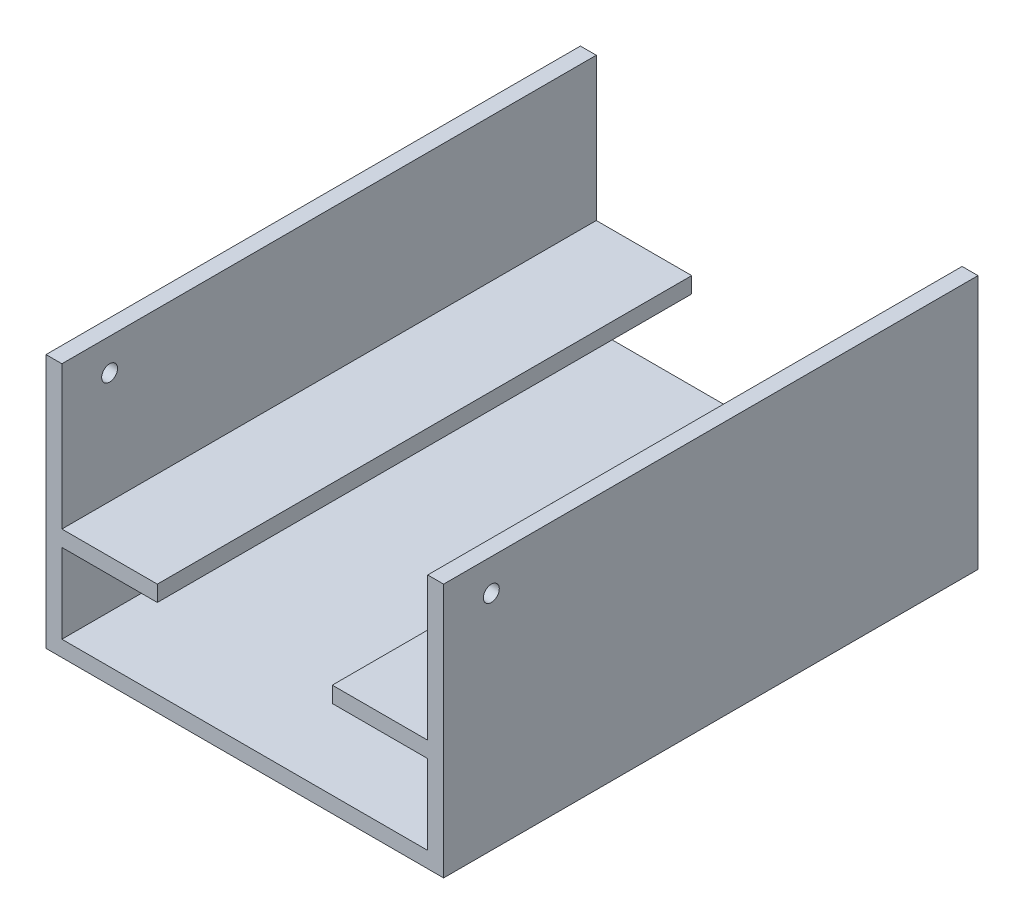
ISO-10303-21;
HEADER;
FILE_DESCRIPTION(('STEP AP214'),'2;1');
FILE_NAME('part.step','',(''),(''),'','','');
FILE_SCHEMA(('AUTOMOTIVE_DESIGN { 1 0 10303 214 1 1 1 1 }'));
ENDSEC;
DATA;
#1=APPLICATION_CONTEXT('core data for automotive mechanical design processes');
#2=APPLICATION_PROTOCOL_DEFINITION('international standard','automotive_design',2000,#1);
#3=PRODUCT_CONTEXT('',#1,'mechanical');
#4=PRODUCT('Part','Part','',(#3));
#5=PRODUCT_RELATED_PRODUCT_CATEGORY('part','',(#4));
#6=PRODUCT_DEFINITION_FORMATION('','',#4);
#7=PRODUCT_DEFINITION_CONTEXT('part definition',#1,'design');
#8=PRODUCT_DEFINITION('design','',#6,#7);
#9=PRODUCT_DEFINITION_SHAPE('','',#8);
#10=(LENGTH_UNIT() NAMED_UNIT(*) SI_UNIT(.MILLI.,.METRE.));
#11=(NAMED_UNIT(*) PLANE_ANGLE_UNIT() SI_UNIT($,.RADIAN.));
#12=(NAMED_UNIT(*) SI_UNIT($,.STERADIAN.) SOLID_ANGLE_UNIT());
#13=UNCERTAINTY_MEASURE_WITH_UNIT(LENGTH_MEASURE(1.E-05),#10,'distance_accuracy_value','');
#14=(GEOMETRIC_REPRESENTATION_CONTEXT(3) GLOBAL_UNCERTAINTY_ASSIGNED_CONTEXT((#13)) GLOBAL_UNIT_ASSIGNED_CONTEXT((#10,
#11,#12)) REPRESENTATION_CONTEXT('',''));
#15=CARTESIAN_POINT('',(0.,0.,0.));
#16=DIRECTION('',(0.,0.,1.));
#17=DIRECTION('',(1.,0.,0.));
#18=AXIS2_PLACEMENT_3D('',#15,#16,#17);
#19=CARTESIAN_POINT('',(120.,80.,-168.));
#20=DIRECTION('',(1.,0.,0.));
#21=DIRECTION('',(0.,0.,-1.));
#22=AXIS2_PLACEMENT_3D('',#19,#20,#21);
#23=PLANE('',#22);
#24=DIRECTION('',(0.,0.,-1.));
#25=VECTOR('',#24,1.);
#26=CARTESIAN_POINT('',(120.,35.,-168.));
#27=LINE('',#26,#25);
#28=CARTESIAN_POINT('',(120.,35.,0.));
#29=VERTEX_POINT('',#28);
#30=CARTESIAN_POINT('',(120.,35.,-168.));
#31=VERTEX_POINT('',#30);
#32=EDGE_CURVE('E165',#29,#31,#27,.T.);
#33=ORIENTED_EDGE('',*,*,#32,.F.);
#34=DIRECTION('',(0.,-1.,0.));
#35=VECTOR('',#34,1.);
#36=CARTESIAN_POINT('',(120.,80.,0.));
#37=LINE('',#36,#35);
#38=CARTESIAN_POINT('',(120.,80.,0.));
#39=VERTEX_POINT('',#38);
#40=EDGE_CURVE('E214',#39,#29,#37,.T.);
#41=ORIENTED_EDGE('',*,*,#40,.F.);
#42=DIRECTION('',(0.,0.,1.));
#43=VECTOR('',#42,1.);
#44=CARTESIAN_POINT('',(120.,80.,-168.));
#45=LINE('',#44,#43);
#46=CARTESIAN_POINT('',(120.,80.,-168.));
#47=VERTEX_POINT('',#46);
#48=EDGE_CURVE('E208',#47,#39,#45,.T.);
#49=ORIENTED_EDGE('',*,*,#48,.F.);
#50=DIRECTION('',(0.,-1.,0.));
#51=VECTOR('',#50,1.);
#52=CARTESIAN_POINT('',(120.,80.,-168.));
#53=LINE('',#52,#51);
#54=EDGE_CURVE('E217',#47,#31,#53,.T.);
#55=ORIENTED_EDGE('',*,*,#54,.T.);
#56=EDGE_LOOP('',(#33,#41,#49,#55));
#57=FACE_BOUND('',#56,.T.);
#58=CARTESIAN_POINT('',(120.,70.,-15.));
#59=DIRECTION('',(1.,0.,0.));
#60=DIRECTION('',(0.,0.,-1.));
#61=AXIS2_PLACEMENT_3D('',#58,#59,#60);
#62=CIRCLE('',#61,2.5);
#63=CARTESIAN_POINT('',(120.,70.,-17.5));
#64=VERTEX_POINT('',#63);
#65=EDGE_CURVE('E314',#64,#64,#62,.F.);
#66=ORIENTED_EDGE('',*,*,#65,.F.);
#67=EDGE_LOOP('',(#66));
#68=FACE_BOUND('',#67,.T.);
#69=ADVANCED_FACE('F33',(#57,#68),#23,.F.);
#70=CARTESIAN_POINT('',(5.,80.,0.));
#71=DIRECTION('',(-1.,0.,0.));
#72=DIRECTION('',(0.,0.,1.));
#73=AXIS2_PLACEMENT_3D('',#70,#71,#72);
#74=PLANE('',#73);
#75=DIRECTION('',(0.,0.,1.));
#76=VECTOR('',#75,1.);
#77=CARTESIAN_POINT('',(5.,35.,0.));
#78=LINE('',#77,#76);
#79=CARTESIAN_POINT('',(5.,35.,-168.));
#80=VERTEX_POINT('',#79);
#81=CARTESIAN_POINT('',(5.,35.,0.));
#82=VERTEX_POINT('',#81);
#83=EDGE_CURVE('E173',#80,#82,#78,.T.);
#84=ORIENTED_EDGE('',*,*,#83,.F.);
#85=DIRECTION('',(0.,-1.,0.));
#86=VECTOR('',#85,1.);
#87=CARTESIAN_POINT('',(5.,80.,-168.));
#88=LINE('',#87,#86);
#89=CARTESIAN_POINT('',(5.,80.,-168.));
#90=VERTEX_POINT('',#89);
#91=EDGE_CURVE('E251',#90,#80,#88,.T.);
#92=ORIENTED_EDGE('',*,*,#91,.F.);
#93=DIRECTION('',(0.,0.,-1.));
#94=VECTOR('',#93,1.);
#95=CARTESIAN_POINT('',(5.,80.,0.));
#96=LINE('',#95,#94);
#97=CARTESIAN_POINT('',(5.,80.,0.));
#98=VERTEX_POINT('',#97);
#99=EDGE_CURVE('E223',#98,#90,#96,.T.);
#100=ORIENTED_EDGE('',*,*,#99,.F.);
#101=DIRECTION('',(0.,-1.,0.));
#102=VECTOR('',#101,1.);
#103=CARTESIAN_POINT('',(5.,80.,0.));
#104=LINE('',#103,#102);
#105=EDGE_CURVE('E242',#98,#82,#104,.T.);
#106=ORIENTED_EDGE('',*,*,#105,.T.);
#107=EDGE_LOOP('',(#84,#92,#100,#106));
#108=FACE_BOUND('',#107,.T.);
#109=CARTESIAN_POINT('',(5.,70.,-15.));
#110=DIRECTION('',(-1.,0.,0.));
#111=DIRECTION('',(0.,0.,1.));
#112=AXIS2_PLACEMENT_3D('',#109,#110,#111);
#113=CIRCLE('',#112,2.5);
#114=CARTESIAN_POINT('',(5.,70.,-12.5));
#115=VERTEX_POINT('',#114);
#116=EDGE_CURVE('E319',#115,#115,#113,.F.);
#117=ORIENTED_EDGE('',*,*,#116,.F.);
#118=EDGE_LOOP('',(#117));
#119=FACE_BOUND('',#118,.T.);
#120=ADVANCED_FACE('F340',(#108,#119),#74,.F.);
#121=CARTESIAN_POINT('',(0.,5.,0.));
#122=DIRECTION('',(1.,0.,0.));
#123=DIRECTION('',(0.,0.,-1.));
#124=AXIS2_PLACEMENT_3D('',#121,#122,#123);
#125=PLANE('',#124);
#126=DIRECTION('',(0.,0.,1.));
#127=VECTOR('',#126,1.);
#128=CARTESIAN_POINT('',(0.,0.,0.));
#129=LINE('',#128,#127);
#130=CARTESIAN_POINT('',(0.,0.,-168.));
#131=VERTEX_POINT('',#130);
#132=CARTESIAN_POINT('',(0.,0.,0.));
#133=VERTEX_POINT('',#132);
#134=EDGE_CURVE('E244',#131,#133,#129,.T.);
#135=ORIENTED_EDGE('',*,*,#134,.T.);
#136=DIRECTION('',(0.,-1.,0.));
#137=VECTOR('',#136,1.);
#138=CARTESIAN_POINT('',(0.,5.,0.));
#139=LINE('',#138,#137);
#140=CARTESIAN_POINT('',(0.,80.,0.));
#141=VERTEX_POINT('',#140);
#142=EDGE_CURVE('E11',#141,#133,#139,.T.);
#143=ORIENTED_EDGE('',*,*,#142,.F.);
#144=DIRECTION('',(0.,0.,-1.));
#145=VECTOR('',#144,1.);
#146=CARTESIAN_POINT('',(0.,80.,0.));
#147=LINE('',#146,#145);
#148=CARTESIAN_POINT('',(0.,80.,-168.));
#149=VERTEX_POINT('',#148);
#150=EDGE_CURVE('E228',#141,#149,#147,.T.);
#151=ORIENTED_EDGE('',*,*,#150,.T.);
#152=DIRECTION('',(0.,-1.,0.));
#153=VECTOR('',#152,1.);
#154=CARTESIAN_POINT('',(0.,5.,-168.));
#155=LINE('',#154,#153);
#156=EDGE_CURVE('E266',#149,#131,#155,.T.);
#157=ORIENTED_EDGE('',*,*,#156,.T.);
#158=EDGE_LOOP('',(#135,#143,#151,#157));
#159=FACE_BOUND('',#158,.T.);
#160=CARTESIAN_POINT('',(0.,70.,-15.));
#161=DIRECTION('',(1.,0.,0.));
#162=DIRECTION('',(0.,0.,-1.));
#163=AXIS2_PLACEMENT_3D('',#160,#161,#162);
#164=CIRCLE('',#163,2.5);
#165=CARTESIAN_POINT('',(0.,70.,-17.5));
#166=VERTEX_POINT('',#165);
#167=EDGE_CURVE('E322',#166,#166,#164,.F.);
#168=ORIENTED_EDGE('',*,*,#167,.F.);
#169=EDGE_LOOP('',(#168));
#170=FACE_BOUND('',#169,.T.);
#171=ADVANCED_FACE('F35',(#159,#170),#125,.F.);
#172=CARTESIAN_POINT('',(125.,5.,0.));
#173=DIRECTION('',(-1.,0.,0.));
#174=DIRECTION('',(0.,0.,1.));
#175=AXIS2_PLACEMENT_3D('',#172,#173,#174);
#176=PLANE('',#175);
#177=DIRECTION('',(0.,0.,-1.));
#178=VECTOR('',#177,1.);
#179=CARTESIAN_POINT('',(125.,0.,0.));
#180=LINE('',#179,#178);
#181=CARTESIAN_POINT('',(125.,0.,0.));
#182=VERTEX_POINT('',#181);
#183=CARTESIAN_POINT('',(125.,0.,-168.));
#184=VERTEX_POINT('',#183);
#185=EDGE_CURVE('E270',#182,#184,#180,.T.);
#186=ORIENTED_EDGE('',*,*,#185,.T.);
#187=DIRECTION('',(0.,-1.,0.));
#188=VECTOR('',#187,1.);
#189=CARTESIAN_POINT('',(125.,5.,-168.));
#190=LINE('',#189,#188);
#191=CARTESIAN_POINT('',(125.,80.,-168.));
#192=VERTEX_POINT('',#191);
#193=EDGE_CURVE('E263',#192,#184,#190,.T.);
#194=ORIENTED_EDGE('',*,*,#193,.F.);
#195=DIRECTION('',(0.,0.,-1.));
#196=VECTOR('',#195,1.);
#197=CARTESIAN_POINT('',(125.,80.,-168.));
#198=LINE('',#197,#196);
#199=CARTESIAN_POINT('',(125.,80.,0.));
#200=VERTEX_POINT('',#199);
#201=EDGE_CURVE('E203',#200,#192,#198,.T.);
#202=ORIENTED_EDGE('',*,*,#201,.F.);
#203=DIRECTION('',(0.,-1.,0.));
#204=VECTOR('',#203,1.);
#205=CARTESIAN_POINT('',(125.,5.,0.));
#206=LINE('',#205,#204);
#207=EDGE_CURVE('E42',#200,#182,#206,.T.);
#208=ORIENTED_EDGE('',*,*,#207,.T.);
#209=EDGE_LOOP('',(#186,#194,#202,#208));
#210=FACE_BOUND('',#209,.T.);
#211=CARTESIAN_POINT('',(125.,70.,-15.));
#212=DIRECTION('',(-1.,0.,0.));
#213=DIRECTION('',(0.,0.,1.));
#214=AXIS2_PLACEMENT_3D('',#211,#212,#213);
#215=CIRCLE('',#214,2.5);
#216=CARTESIAN_POINT('',(125.,70.,-12.5));
#217=VERTEX_POINT('',#216);
#218=EDGE_CURVE('E37',#217,#217,#215,.F.);
#219=ORIENTED_EDGE('',*,*,#218,.F.);
#220=EDGE_LOOP('',(#219));
#221=FACE_BOUND('',#220,.T.);
#222=ADVANCED_FACE('F295',(#210,#221),#176,.F.);
#223=DIRECTION('',(0.,0.,1.));
#224=VECTOR('',#223,1.);
#225=CARTESIAN_POINT('',(120.,30.,-168.));
#226=LINE('',#225,#224);
#227=CARTESIAN_POINT('',(120.,30.,-168.));
#228=VERTEX_POINT('',#227);
#229=CARTESIAN_POINT('',(120.,30.,0.));
#230=VERTEX_POINT('',#229);
#231=EDGE_CURVE('E50',#228,#230,#226,.T.);
#232=ORIENTED_EDGE('',*,*,#231,.F.);
#233=CARTESIAN_POINT('',(120.,5.,-168.));
#234=VERTEX_POINT('',#233);
#235=EDGE_CURVE('E169',#228,#234,#53,.T.);
#236=ORIENTED_EDGE('',*,*,#235,.T.);
#237=DIRECTION('',(0.,0.,1.));
#238=VECTOR('',#237,1.);
#239=CARTESIAN_POINT('',(120.,5.,-168.));
#240=LINE('',#239,#238);
#241=CARTESIAN_POINT('',(120.,5.,0.));
#242=VERTEX_POINT('',#241);
#243=EDGE_CURVE('E202',#234,#242,#240,.T.);
#244=ORIENTED_EDGE('',*,*,#243,.T.);
#245=EDGE_CURVE('E55',#230,#242,#37,.T.);
#246=ORIENTED_EDGE('',*,*,#245,.F.);
#247=EDGE_LOOP('',(#232,#236,#244,#246));
#248=FACE_BOUND('',#247,.T.);
#249=ADVANCED_FACE('F332',(#248),#23,.F.);
#250=DIRECTION('',(0.,0.,-1.));
#251=VECTOR('',#250,1.);
#252=CARTESIAN_POINT('',(5.,30.,0.));
#253=LINE('',#252,#251);
#254=CARTESIAN_POINT('',(5.,30.,0.));
#255=VERTEX_POINT('',#254);
#256=CARTESIAN_POINT('',(5.,30.,-168.));
#257=VERTEX_POINT('',#256);
#258=EDGE_CURVE('E170',#255,#257,#253,.T.);
#259=ORIENTED_EDGE('',*,*,#258,.F.);
#260=CARTESIAN_POINT('',(5.,5.,0.));
#261=VERTEX_POINT('',#260);
#262=EDGE_CURVE('E245',#255,#261,#104,.T.);
#263=ORIENTED_EDGE('',*,*,#262,.T.);
#264=DIRECTION('',(0.,0.,-1.));
#265=VECTOR('',#264,1.);
#266=CARTESIAN_POINT('',(5.,5.,0.));
#267=LINE('',#266,#265);
#268=CARTESIAN_POINT('',(5.,5.,-168.));
#269=VERTEX_POINT('',#268);
#270=EDGE_CURVE('E219',#261,#269,#267,.T.);
#271=ORIENTED_EDGE('',*,*,#270,.T.);
#272=EDGE_CURVE('E231',#257,#269,#88,.T.);
#273=ORIENTED_EDGE('',*,*,#272,.F.);
#274=EDGE_LOOP('',(#259,#263,#271,#273));
#275=FACE_BOUND('',#274,.T.);
#276=ADVANCED_FACE('F338',(#275),#74,.F.);
#277=CARTESIAN_POINT('',(0.,5.,0.));
#278=DIRECTION('',(0.,-1.,0.));
#279=DIRECTION('',(0.,0.,-1.));
#280=AXIS2_PLACEMENT_3D('',#277,#278,#279);
#281=PLANE('',#280);
#282=ORIENTED_EDGE('',*,*,#243,.F.);
#283=DIRECTION('',(-1.,0.,0.));
#284=VECTOR('',#283,1.);
#285=CARTESIAN_POINT('',(0.,5.,-168.));
#286=LINE('',#285,#284);
#287=EDGE_CURVE('E248',#234,#269,#286,.T.);
#288=ORIENTED_EDGE('',*,*,#287,.T.);
#289=ORIENTED_EDGE('',*,*,#270,.F.);
#290=DIRECTION('',(1.,0.,0.));
#291=VECTOR('',#290,1.);
#292=CARTESIAN_POINT('',(0.,5.,0.));
#293=LINE('',#292,#291);
#294=EDGE_CURVE('E257',#261,#242,#293,.T.);
#295=ORIENTED_EDGE('',*,*,#294,.T.);
#296=EDGE_LOOP('',(#282,#288,#289,#295));
#297=FACE_BOUND('',#296,.T.);
#298=ADVANCED_FACE('F354',(#297),#281,.F.);
#299=CARTESIAN_POINT('',(0.,5.,0.));
#300=DIRECTION('',(0.,0.,-1.));
#301=DIRECTION('',(-1.,0.,0.));
#302=AXIS2_PLACEMENT_3D('',#299,#300,#301);
#303=PLANE('',#302);
#304=DIRECTION('',(1.,0.,0.));
#305=VECTOR('',#304,1.);
#306=CARTESIAN_POINT('',(0.,0.,0.));
#307=LINE('',#306,#305);
#308=EDGE_CURVE('E272',#133,#182,#307,.T.);
#309=ORIENTED_EDGE('',*,*,#308,.T.);
#310=ORIENTED_EDGE('',*,*,#207,.F.);
#311=DIRECTION('',(1.,0.,0.));
#312=VECTOR('',#311,1.);
#313=CARTESIAN_POINT('',(125.,80.,0.));
#314=LINE('',#313,#312);
#315=EDGE_CURVE('E210',#39,#200,#314,.T.);
#316=ORIENTED_EDGE('',*,*,#315,.F.);
#317=ORIENTED_EDGE('',*,*,#40,.T.);
#318=DIRECTION('',(1.,0.,0.));
#319=VECTOR('',#318,1.);
#320=CARTESIAN_POINT('',(90.,35.,0.));
#321=LINE('',#320,#319);
#322=CARTESIAN_POINT('',(90.,35.,0.));
#323=VERTEX_POINT('',#322);
#324=EDGE_CURVE('E175',#323,#29,#321,.T.);
#325=ORIENTED_EDGE('',*,*,#324,.F.);
#326=DIRECTION('',(0.,1.,0.));
#327=VECTOR('',#326,1.);
#328=CARTESIAN_POINT('',(90.,30.,0.));
#329=LINE('',#328,#327);
#330=CARTESIAN_POINT('',(90.,30.,0.));
#331=VERTEX_POINT('',#330);
#332=EDGE_CURVE('E155',#331,#323,#329,.T.);
#333=ORIENTED_EDGE('',*,*,#332,.F.);
#334=DIRECTION('',(1.,0.,0.));
#335=VECTOR('',#334,1.);
#336=CARTESIAN_POINT('',(90.,30.,0.));
#337=LINE('',#336,#335);
#338=EDGE_CURVE('E152',#331,#230,#337,.T.);
#339=ORIENTED_EDGE('',*,*,#338,.T.);
#340=ORIENTED_EDGE('',*,*,#245,.T.);
#341=ORIENTED_EDGE('',*,*,#294,.F.);
#342=ORIENTED_EDGE('',*,*,#262,.F.);
#343=DIRECTION('',(-1.,0.,0.));
#344=VECTOR('',#343,1.);
#345=CARTESIAN_POINT('',(35.,30.,0.));
#346=LINE('',#345,#344);
#347=CARTESIAN_POINT('',(35.,30.,0.));
#348=VERTEX_POINT('',#347);
#349=EDGE_CURVE('E199',#348,#255,#346,.T.);
#350=ORIENTED_EDGE('',*,*,#349,.F.);
#351=DIRECTION('',(0.,-1.,0.));
#352=VECTOR('',#351,1.);
#353=CARTESIAN_POINT('',(35.,30.,0.));
#354=LINE('',#353,#352);
#355=CARTESIAN_POINT('',(35.,35.,0.));
#356=VERTEX_POINT('',#355);
#357=EDGE_CURVE('E179',#356,#348,#354,.T.);
#358=ORIENTED_EDGE('',*,*,#357,.F.);
#359=DIRECTION('',(-1.,0.,0.));
#360=VECTOR('',#359,1.);
#361=CARTESIAN_POINT('',(35.,35.,0.));
#362=LINE('',#361,#360);
#363=EDGE_CURVE('E187',#356,#82,#362,.T.);
#364=ORIENTED_EDGE('',*,*,#363,.T.);
#365=ORIENTED_EDGE('',*,*,#105,.F.);
#366=DIRECTION('',(1.,0.,0.));
#367=VECTOR('',#366,1.);
#368=CARTESIAN_POINT('',(0.,80.,0.));
#369=LINE('',#368,#367);
#370=EDGE_CURVE('E220',#141,#98,#369,.T.);
#371=ORIENTED_EDGE('',*,*,#370,.F.);
#372=ORIENTED_EDGE('',*,*,#142,.T.);
#373=EDGE_LOOP('',(#309,#310,#316,#317,#325,#333,#339,#340,#341,#342,#350,#358,#364,#365,#371,#372));
#374=FACE_BOUND('',#373,.T.);
#375=ADVANCED_FACE('F285',(#374),#303,.F.);
#376=CARTESIAN_POINT('',(0.,5.,-168.));
#377=DIRECTION('',(0.,0.,1.));
#378=DIRECTION('',(1.,0.,0.));
#379=AXIS2_PLACEMENT_3D('',#376,#377,#378);
#380=PLANE('',#379);
#381=DIRECTION('',(-1.,0.,0.));
#382=VECTOR('',#381,1.);
#383=CARTESIAN_POINT('',(0.,0.,-168.));
#384=LINE('',#383,#382);
#385=EDGE_CURVE('E259',#184,#131,#384,.T.);
#386=ORIENTED_EDGE('',*,*,#385,.T.);
#387=ORIENTED_EDGE('',*,*,#156,.F.);
#388=DIRECTION('',(1.,0.,0.));
#389=VECTOR('',#388,1.);
#390=CARTESIAN_POINT('',(0.,80.,-168.));
#391=LINE('',#390,#389);
#392=EDGE_CURVE('E225',#149,#90,#391,.T.);
#393=ORIENTED_EDGE('',*,*,#392,.T.);
#394=ORIENTED_EDGE('',*,*,#91,.T.);
#395=DIRECTION('',(-1.,0.,0.));
#396=VECTOR('',#395,1.);
#397=CARTESIAN_POINT('',(35.,35.,-168.));
#398=LINE('',#397,#396);
#399=CARTESIAN_POINT('',(35.,35.,-168.));
#400=VERTEX_POINT('',#399);
#401=EDGE_CURVE('E193',#400,#80,#398,.T.);
#402=ORIENTED_EDGE('',*,*,#401,.F.);
#403=DIRECTION('',(0.,1.,0.));
#404=VECTOR('',#403,1.);
#405=CARTESIAN_POINT('',(35.,30.,-168.));
#406=LINE('',#405,#404);
#407=CARTESIAN_POINT('',(35.,30.,-168.));
#408=VERTEX_POINT('',#407);
#409=EDGE_CURVE('E184',#408,#400,#406,.T.);
#410=ORIENTED_EDGE('',*,*,#409,.F.);
#411=DIRECTION('',(-1.,0.,0.));
#412=VECTOR('',#411,1.);
#413=CARTESIAN_POINT('',(35.,30.,-168.));
#414=LINE('',#413,#412);
#415=EDGE_CURVE('E196',#408,#257,#414,.T.);
#416=ORIENTED_EDGE('',*,*,#415,.T.);
#417=ORIENTED_EDGE('',*,*,#272,.T.);
#418=ORIENTED_EDGE('',*,*,#287,.F.);
#419=ORIENTED_EDGE('',*,*,#235,.F.);
#420=DIRECTION('',(1.,0.,0.));
#421=VECTOR('',#420,1.);
#422=CARTESIAN_POINT('',(90.,30.,-168.));
#423=LINE('',#422,#421);
#424=CARTESIAN_POINT('',(90.,30.,-168.));
#425=VERTEX_POINT('',#424);
#426=EDGE_CURVE('E150',#425,#228,#423,.T.);
#427=ORIENTED_EDGE('',*,*,#426,.F.);
#428=DIRECTION('',(0.,-1.,0.));
#429=VECTOR('',#428,1.);
#430=CARTESIAN_POINT('',(90.,30.,-168.));
#431=LINE('',#430,#429);
#432=CARTESIAN_POINT('',(90.,35.,-168.));
#433=VERTEX_POINT('',#432);
#434=EDGE_CURVE('E156',#433,#425,#431,.T.);
#435=ORIENTED_EDGE('',*,*,#434,.F.);
#436=DIRECTION('',(1.,0.,0.));
#437=VECTOR('',#436,1.);
#438=CARTESIAN_POINT('',(90.,35.,-168.));
#439=LINE('',#438,#437);
#440=EDGE_CURVE('E309',#433,#31,#439,.T.);
#441=ORIENTED_EDGE('',*,*,#440,.T.);
#442=ORIENTED_EDGE('',*,*,#54,.F.);
#443=DIRECTION('',(-1.,0.,0.));
#444=VECTOR('',#443,1.);
#445=CARTESIAN_POINT('',(125.,80.,-168.));
#446=LINE('',#445,#444);
#447=EDGE_CURVE('E206',#192,#47,#446,.T.);
#448=ORIENTED_EDGE('',*,*,#447,.F.);
#449=ORIENTED_EDGE('',*,*,#193,.T.);
#450=EDGE_LOOP('',(#386,#387,#393,#394,#402,#410,#416,#417,#418,#419,#427,#435,#441,#442,#448,#449));
#451=FACE_BOUND('',#450,.T.);
#452=ADVANCED_FACE('F167',(#451),#380,.F.);
#453=CARTESIAN_POINT('',(0.,0.,0.));
#454=DIRECTION('',(0.,-1.,0.));
#455=DIRECTION('',(0.,0.,-1.));
#456=AXIS2_PLACEMENT_3D('',#453,#454,#455);
#457=PLANE('',#456);
#458=ORIENTED_EDGE('',*,*,#134,.F.);
#459=ORIENTED_EDGE('',*,*,#385,.F.);
#460=ORIENTED_EDGE('',*,*,#185,.F.);
#461=ORIENTED_EDGE('',*,*,#308,.F.);
#462=EDGE_LOOP('',(#458,#459,#460,#461));
#463=FACE_BOUND('',#462,.T.);
#464=ADVANCED_FACE('F282',(#463),#457,.T.);
#465=CARTESIAN_POINT('',(0.,80.,0.));
#466=DIRECTION('',(0.,1.,0.));
#467=DIRECTION('',(0.,0.,1.));
#468=AXIS2_PLACEMENT_3D('',#465,#466,#467);
#469=PLANE('',#468);
#470=ORIENTED_EDGE('',*,*,#370,.T.);
#471=ORIENTED_EDGE('',*,*,#99,.T.);
#472=ORIENTED_EDGE('',*,*,#392,.F.);
#473=ORIENTED_EDGE('',*,*,#150,.F.);
#474=EDGE_LOOP('',(#470,#471,#472,#473));
#475=FACE_BOUND('',#474,.T.);
#476=ADVANCED_FACE('F290',(#475),#469,.T.);
#477=CARTESIAN_POINT('',(0.,80.,0.));
#478=DIRECTION('',(0.,-1.,0.));
#479=DIRECTION('',(0.,0.,-1.));
#480=AXIS2_PLACEMENT_3D('',#477,#478,#479);
#481=PLANE('',#480);
#482=ORIENTED_EDGE('',*,*,#201,.T.);
#483=ORIENTED_EDGE('',*,*,#447,.T.);
#484=ORIENTED_EDGE('',*,*,#48,.T.);
#485=ORIENTED_EDGE('',*,*,#315,.T.);
#486=EDGE_LOOP('',(#482,#483,#484,#485));
#487=FACE_BOUND('',#486,.T.);
#488=ADVANCED_FACE('F299',(#487),#481,.F.);
#489=CARTESIAN_POINT('',(35.,30.,0.));
#490=DIRECTION('',(0.,1.,0.));
#491=DIRECTION('',(0.,0.,1.));
#492=AXIS2_PLACEMENT_3D('',#489,#490,#491);
#493=PLANE('',#492);
#494=ORIENTED_EDGE('',*,*,#258,.T.);
#495=ORIENTED_EDGE('',*,*,#415,.F.);
#496=DIRECTION('',(0.,0.,-1.));
#497=VECTOR('',#496,1.);
#498=CARTESIAN_POINT('',(35.,30.,0.));
#499=LINE('',#498,#497);
#500=EDGE_CURVE('E182',#348,#408,#499,.T.);
#501=ORIENTED_EDGE('',*,*,#500,.F.);
#502=ORIENTED_EDGE('',*,*,#349,.T.);
#503=EDGE_LOOP('',(#494,#495,#501,#502));
#504=FACE_BOUND('',#503,.T.);
#505=ADVANCED_FACE('F401',(#504),#493,.F.);
#506=CARTESIAN_POINT('',(35.,35.,0.));
#507=DIRECTION('',(0.,-1.,0.));
#508=DIRECTION('',(0.,0.,-1.));
#509=AXIS2_PLACEMENT_3D('',#506,#507,#508);
#510=PLANE('',#509);
#511=ORIENTED_EDGE('',*,*,#83,.T.);
#512=ORIENTED_EDGE('',*,*,#363,.F.);
#513=DIRECTION('',(0.,0.,1.));
#514=VECTOR('',#513,1.);
#515=CARTESIAN_POINT('',(35.,35.,0.));
#516=LINE('',#515,#514);
#517=EDGE_CURVE('E186',#400,#356,#516,.T.);
#518=ORIENTED_EDGE('',*,*,#517,.F.);
#519=ORIENTED_EDGE('',*,*,#401,.T.);
#520=EDGE_LOOP('',(#511,#512,#518,#519));
#521=FACE_BOUND('',#520,.T.);
#522=ADVANCED_FACE('F391',(#521),#510,.F.);
#523=CARTESIAN_POINT('',(35.,0.,0.));
#524=DIRECTION('',(-1.,0.,0.));
#525=DIRECTION('',(0.,0.,1.));
#526=AXIS2_PLACEMENT_3D('',#523,#524,#525);
#527=PLANE('',#526);
#528=ORIENTED_EDGE('',*,*,#357,.T.);
#529=ORIENTED_EDGE('',*,*,#500,.T.);
#530=ORIENTED_EDGE('',*,*,#409,.T.);
#531=ORIENTED_EDGE('',*,*,#517,.T.);
#532=EDGE_LOOP('',(#528,#529,#530,#531));
#533=FACE_BOUND('',#532,.T.);
#534=ADVANCED_FACE('F387',(#533),#527,.F.);
#535=CARTESIAN_POINT('',(90.,30.,-168.));
#536=DIRECTION('',(0.,1.,0.));
#537=DIRECTION('',(0.,0.,1.));
#538=AXIS2_PLACEMENT_3D('',#535,#536,#537);
#539=PLANE('',#538);
#540=ORIENTED_EDGE('',*,*,#231,.T.);
#541=ORIENTED_EDGE('',*,*,#338,.F.);
#542=DIRECTION('',(0.,0.,1.));
#543=VECTOR('',#542,1.);
#544=CARTESIAN_POINT('',(90.,30.,-168.));
#545=LINE('',#544,#543);
#546=EDGE_CURVE('E146',#425,#331,#545,.T.);
#547=ORIENTED_EDGE('',*,*,#546,.F.);
#548=ORIENTED_EDGE('',*,*,#426,.T.);
#549=EDGE_LOOP('',(#540,#541,#547,#548));
#550=FACE_BOUND('',#549,.T.);
#551=ADVANCED_FACE('F148',(#550),#539,.F.);
#552=CARTESIAN_POINT('',(90.,35.,-168.));
#553=DIRECTION('',(0.,-1.,0.));
#554=DIRECTION('',(0.,0.,-1.));
#555=AXIS2_PLACEMENT_3D('',#552,#553,#554);
#556=PLANE('',#555);
#557=ORIENTED_EDGE('',*,*,#32,.T.);
#558=ORIENTED_EDGE('',*,*,#440,.F.);
#559=DIRECTION('',(0.,0.,-1.));
#560=VECTOR('',#559,1.);
#561=CARTESIAN_POINT('',(90.,35.,-168.));
#562=LINE('',#561,#560);
#563=EDGE_CURVE('E161',#323,#433,#562,.T.);
#564=ORIENTED_EDGE('',*,*,#563,.F.);
#565=ORIENTED_EDGE('',*,*,#324,.T.);
#566=EDGE_LOOP('',(#557,#558,#564,#565));
#567=FACE_BOUND('',#566,.T.);
#568=ADVANCED_FACE('F308',(#567),#556,.F.);
#569=CARTESIAN_POINT('',(90.,0.,0.));
#570=DIRECTION('',(1.,0.,0.));
#571=DIRECTION('',(0.,0.,-1.));
#572=AXIS2_PLACEMENT_3D('',#569,#570,#571);
#573=PLANE('',#572);
#574=ORIENTED_EDGE('',*,*,#434,.T.);
#575=ORIENTED_EDGE('',*,*,#546,.T.);
#576=ORIENTED_EDGE('',*,*,#332,.T.);
#577=ORIENTED_EDGE('',*,*,#563,.T.);
#578=EDGE_LOOP('',(#574,#575,#576,#577));
#579=FACE_BOUND('',#578,.T.);
#580=ADVANCED_FACE('F159',(#579),#573,.F.);
#581=CARTESIAN_POINT('',(-31.,70.,-15.));
#582=DIRECTION('',(1.,0.,0.));
#583=DIRECTION('',(0.,0.,-1.));
#584=AXIS2_PLACEMENT_3D('',#581,#582,#583);
#585=CYLINDRICAL_SURFACE('',#584,2.5);
#586=ORIENTED_EDGE('',*,*,#218,.T.);
#587=EDGE_LOOP('',(#586));
#588=FACE_BOUND('',#587,.T.);
#589=ORIENTED_EDGE('',*,*,#65,.T.);
#590=EDGE_LOOP('',(#589));
#591=FACE_BOUND('',#590,.T.);
#592=ADVANCED_FACE('F329',(#588,#591),#585,.F.);
#593=ORIENTED_EDGE('',*,*,#167,.T.);
#594=EDGE_LOOP('',(#593));
#595=FACE_BOUND('',#594,.T.);
#596=ORIENTED_EDGE('',*,*,#116,.T.);
#597=EDGE_LOOP('',(#596));
#598=FACE_BOUND('',#597,.T.);
#599=ADVANCED_FACE('F515',(#595,#598),#585,.F.);
#600=CLOSED_SHELL('',(#69,#120,#171,#222,#249,#276,#298,#375,#452,#464,#476,#488,#505,#522,#534,
#551,#568,#580,#592,#599));
#601=MANIFOLD_SOLID_BREP('B2',#600);
#602=ADVANCED_BREP_SHAPE_REPRESENTATION('',(#18,#601),#14);
#603=SHAPE_DEFINITION_REPRESENTATION(#9,#602);
ENDSEC;
END-ISO-10303-21;
